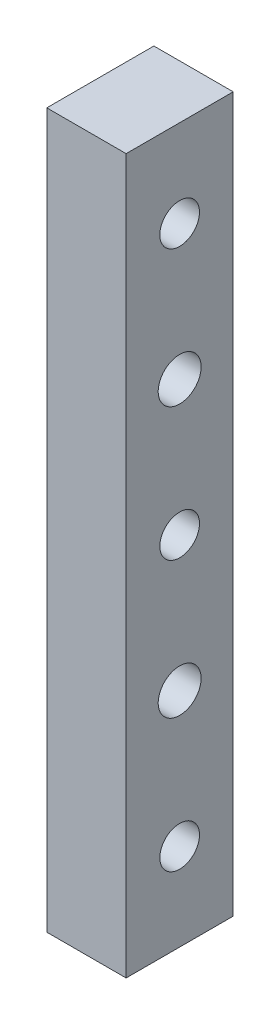
ISO-10303-21;
HEADER;
FILE_DESCRIPTION(('STEP AP214'),'2;1');
FILE_NAME('part.step','',(''),(''),'','','');
FILE_SCHEMA(('AUTOMOTIVE_DESIGN { 1 0 10303 214 1 1 1 1 }'));
ENDSEC;
DATA;
#1=APPLICATION_CONTEXT('core data for automotive mechanical design processes');
#2=APPLICATION_PROTOCOL_DEFINITION('international standard','automotive_design',2000,#1);
#3=PRODUCT_CONTEXT('',#1,'mechanical');
#4=PRODUCT('Part','Part','',(#3));
#5=PRODUCT_RELATED_PRODUCT_CATEGORY('part','',(#4));
#6=PRODUCT_DEFINITION_FORMATION('','',#4);
#7=PRODUCT_DEFINITION_CONTEXT('part definition',#1,'design');
#8=PRODUCT_DEFINITION('design','',#6,#7);
#9=PRODUCT_DEFINITION_SHAPE('','',#8);
#10=(LENGTH_UNIT() NAMED_UNIT(*) SI_UNIT(.MILLI.,.METRE.));
#11=(NAMED_UNIT(*) PLANE_ANGLE_UNIT() SI_UNIT($,.RADIAN.));
#12=(NAMED_UNIT(*) SI_UNIT($,.STERADIAN.) SOLID_ANGLE_UNIT());
#13=UNCERTAINTY_MEASURE_WITH_UNIT(LENGTH_MEASURE(1.E-05),#10,'distance_accuracy_value','');
#14=(GEOMETRIC_REPRESENTATION_CONTEXT(3) GLOBAL_UNCERTAINTY_ASSIGNED_CONTEXT((#13)) GLOBAL_UNIT_ASSIGNED_CONTEXT((#10,
#11,#12)) REPRESENTATION_CONTEXT('',''));
#15=CARTESIAN_POINT('',(0.,0.,0.));
#16=DIRECTION('',(0.,0.,1.));
#17=DIRECTION('',(1.,0.,0.));
#18=AXIS2_PLACEMENT_3D('',#15,#16,#17);
#19=CARTESIAN_POINT('',(10.,-25.3721799996099,-1.96509447423416));
#20=DIRECTION('',(1.,0.,0.));
#21=DIRECTION('',(0.,0.,-1.));
#22=AXIS2_PLACEMENT_3D('',#19,#20,#21);
#23=CYLINDRICAL_SURFACE('',#22,2.49999999999998);
#24=CARTESIAN_POINT('',(10.,-25.3721799996099,-1.96509447423416));
#25=DIRECTION('',(1.,0.,0.));
#26=DIRECTION('',(0.,0.,-1.));
#27=AXIS2_PLACEMENT_3D('',#24,#25,#26);
#28=CIRCLE('',#27,2.49999999999999);
#29=CARTESIAN_POINT('',(10.,-25.3721799996099,-4.46509447423415));
#30=VERTEX_POINT('',#29);
#31=EDGE_CURVE('E340',#30,#30,#28,.T.);
#32=ORIENTED_EDGE('',*,*,#31,.T.);
#33=EDGE_LOOP('',(#32));
#34=FACE_BOUND('',#33,.T.);
#35=CARTESIAN_POINT('',(5.,-25.3721799996099,-1.96509447423416));
#36=DIRECTION('',(-1.,0.,0.));
#37=DIRECTION('',(0.,0.,1.));
#38=AXIS2_PLACEMENT_3D('',#35,#36,#37);
#39=CIRCLE('',#38,2.49999999999998);
#40=CARTESIAN_POINT('',(5.,-25.3721799996099,0.534905525765828));
#41=VERTEX_POINT('',#40);
#42=EDGE_CURVE('E39',#41,#41,#39,.F.);
#43=ORIENTED_EDGE('',*,*,#42,.F.);
#44=EDGE_LOOP('',(#43));
#45=FACE_BOUND('',#44,.T.);
#46=ADVANCED_FACE('F35',(#34,#45),#23,.F.);
#47=CARTESIAN_POINT('',(10.,8.62782000039014,-1.96509447423415));
#48=DIRECTION('',(1.,0.,0.));
#49=DIRECTION('',(0.,0.,-1.));
#50=AXIS2_PLACEMENT_3D('',#47,#48,#49);
#51=CYLINDRICAL_SURFACE('',#50,2.49999999999999);
#52=CARTESIAN_POINT('',(10.,8.62782000039014,-1.96509447423415));
#53=DIRECTION('',(1.,0.,0.));
#54=DIRECTION('',(0.,0.,-1.));
#55=AXIS2_PLACEMENT_3D('',#52,#53,#54);
#56=CIRCLE('',#55,2.49999999999999);
#57=CARTESIAN_POINT('',(10.,8.62782000039014,-4.46509447423414));
#58=VERTEX_POINT('',#57);
#59=EDGE_CURVE('E343',#58,#58,#56,.T.);
#60=ORIENTED_EDGE('',*,*,#59,.T.);
#61=EDGE_LOOP('',(#60));
#62=FACE_BOUND('',#61,.T.);
#63=CARTESIAN_POINT('',(5.,8.62782000039014,-1.96509447423415));
#64=DIRECTION('',(-1.,0.,0.));
#65=DIRECTION('',(0.,0.,1.));
#66=AXIS2_PLACEMENT_3D('',#63,#64,#65);
#67=CIRCLE('',#66,2.49999999999999);
#68=CARTESIAN_POINT('',(5.,8.62782000039014,0.534905525765834));
#69=VERTEX_POINT('',#68);
#70=EDGE_CURVE('E278',#69,#69,#67,.F.);
#71=ORIENTED_EDGE('',*,*,#70,.F.);
#72=EDGE_LOOP('',(#71));
#73=FACE_BOUND('',#72,.T.);
#74=ADVANCED_FACE('F390',(#62,#73),#51,.F.);
#75=CARTESIAN_POINT('',(10.,42.6278200003901,-1.96509447423415));
#76=DIRECTION('',(1.,0.,0.));
#77=DIRECTION('',(0.,0.,-1.));
#78=AXIS2_PLACEMENT_3D('',#75,#76,#77);
#79=CYLINDRICAL_SURFACE('',#78,2.49999999999998);
#80=CARTESIAN_POINT('',(10.,42.6278200003901,-1.96509447423415));
#81=DIRECTION('',(1.,0.,0.));
#82=DIRECTION('',(0.,0.,-1.));
#83=AXIS2_PLACEMENT_3D('',#80,#81,#82);
#84=CIRCLE('',#83,2.49999999999999);
#85=CARTESIAN_POINT('',(10.,42.6278200003901,-4.46509447423414));
#86=VERTEX_POINT('',#85);
#87=EDGE_CURVE('E337',#86,#86,#84,.T.);
#88=ORIENTED_EDGE('',*,*,#87,.T.);
#89=EDGE_LOOP('',(#88));
#90=FACE_BOUND('',#89,.T.);
#91=CARTESIAN_POINT('',(5.,42.6278200003901,-1.96509447423415));
#92=DIRECTION('',(-1.,0.,0.));
#93=DIRECTION('',(0.,0.,1.));
#94=AXIS2_PLACEMENT_3D('',#91,#92,#93);
#95=CIRCLE('',#94,2.49999999999998);
#96=CARTESIAN_POINT('',(5.,42.6278200003901,0.534905525765836));
#97=VERTEX_POINT('',#96);
#98=EDGE_CURVE('E326',#97,#97,#95,.F.);
#99=ORIENTED_EDGE('',*,*,#98,.F.);
#100=EDGE_LOOP('',(#99));
#101=FACE_BOUND('',#100,.T.);
#102=ADVANCED_FACE('F392',(#90,#101),#79,.F.);
#103=CARTESIAN_POINT('',(10.,53.6278200003901,4.78490552576585));
#104=DIRECTION('',(0.,0.,-1.));
#105=DIRECTION('',(0.,1.,0.));
#106=AXIS2_PLACEMENT_3D('',#103,#104,#105);
#107=PLANE('',#106);
#108=DIRECTION('',(0.,-1.,0.));
#109=VECTOR('',#108,1.);
#110=CARTESIAN_POINT('',(0.,53.6278200003901,4.78490552576585));
#111=LINE('',#110,#109);
#112=CARTESIAN_POINT('',(0.,53.6278200003901,4.78490552576585));
#113=VERTEX_POINT('',#112);
#114=CARTESIAN_POINT('',(0.,-36.3721799996099,4.78490552576584));
#115=VERTEX_POINT('',#114);
#116=EDGE_CURVE('E358',#113,#115,#111,.T.);
#117=ORIENTED_EDGE('',*,*,#116,.T.);
#118=DIRECTION('',(-1.,0.,0.));
#119=VECTOR('',#118,1.);
#120=CARTESIAN_POINT('',(10.,-36.3721799996099,4.78490552576584));
#121=LINE('',#120,#119);
#122=CARTESIAN_POINT('',(10.,-36.3721799996099,4.78490552576584));
#123=VERTEX_POINT('',#122);
#124=EDGE_CURVE('E11',#123,#115,#121,.T.);
#125=ORIENTED_EDGE('',*,*,#124,.F.);
#126=DIRECTION('',(0.,-1.,0.));
#127=VECTOR('',#126,1.);
#128=CARTESIAN_POINT('',(10.,53.6278200003901,4.78490552576585));
#129=LINE('',#128,#127);
#130=CARTESIAN_POINT('',(10.,53.6278200003901,4.78490552576585));
#131=VERTEX_POINT('',#130);
#132=EDGE_CURVE('E359',#131,#123,#129,.T.);
#133=ORIENTED_EDGE('',*,*,#132,.F.);
#134=DIRECTION('',(-1.,0.,0.));
#135=VECTOR('',#134,1.);
#136=CARTESIAN_POINT('',(10.,53.6278200003901,4.78490552576585));
#137=LINE('',#136,#135);
#138=EDGE_CURVE('E369',#131,#113,#137,.T.);
#139=ORIENTED_EDGE('',*,*,#138,.T.);
#140=EDGE_LOOP('',(#117,#125,#133,#139));
#141=FACE_BOUND('',#140,.T.);
#142=ADVANCED_FACE('F37',(#141),#107,.F.);
#143=CARTESIAN_POINT('',(10.,-36.3721799996099,4.78490552576584));
#144=DIRECTION('',(0.,1.,0.));
#145=DIRECTION('',(0.,0.,1.));
#146=AXIS2_PLACEMENT_3D('',#143,#144,#145);
#147=PLANE('',#146);
#148=DIRECTION('',(0.,0.,-1.));
#149=VECTOR('',#148,1.);
#150=CARTESIAN_POINT('',(0.,-36.3721799996099,4.78490552576584));
#151=LINE('',#150,#149);
#152=CARTESIAN_POINT('',(0.,-36.3721799996099,-8.71509447423416));
#153=VERTEX_POINT('',#152);
#154=EDGE_CURVE('E372',#115,#153,#151,.T.);
#155=ORIENTED_EDGE('',*,*,#154,.T.);
#156=DIRECTION('',(-1.,0.,0.));
#157=VECTOR('',#156,1.);
#158=CARTESIAN_POINT('',(10.,-36.3721799996099,-8.71509447423416));
#159=LINE('',#158,#157);
#160=CARTESIAN_POINT('',(10.,-36.3721799996099,-8.71509447423416));
#161=VERTEX_POINT('',#160);
#162=EDGE_CURVE('E44',#161,#153,#159,.T.);
#163=ORIENTED_EDGE('',*,*,#162,.F.);
#164=DIRECTION('',(0.,0.,-1.));
#165=VECTOR('',#164,1.);
#166=CARTESIAN_POINT('',(10.,-36.3721799996099,4.78490552576584));
#167=LINE('',#166,#165);
#168=EDGE_CURVE('E362',#123,#161,#167,.T.);
#169=ORIENTED_EDGE('',*,*,#168,.F.);
#170=ORIENTED_EDGE('',*,*,#124,.T.);
#171=EDGE_LOOP('',(#155,#163,#169,#170));
#172=FACE_BOUND('',#171,.T.);
#173=ADVANCED_FACE('F427',(#172),#147,.F.);
#174=CARTESIAN_POINT('',(10.,53.6278200003901,-8.71509447423415));
#175=DIRECTION('',(0.,0.,1.));
#176=DIRECTION('',(0.,-1.,0.));
#177=AXIS2_PLACEMENT_3D('',#174,#175,#176);
#178=PLANE('',#177);
#179=DIRECTION('',(0.,1.,0.));
#180=VECTOR('',#179,1.);
#181=CARTESIAN_POINT('',(0.,53.6278200003901,-8.71509447423415));
#182=LINE('',#181,#180);
#183=CARTESIAN_POINT('',(0.,53.6278200003901,-8.71509447423415));
#184=VERTEX_POINT('',#183);
#185=EDGE_CURVE('E374',#153,#184,#182,.T.);
#186=ORIENTED_EDGE('',*,*,#185,.T.);
#187=DIRECTION('',(-1.,0.,0.));
#188=VECTOR('',#187,1.);
#189=CARTESIAN_POINT('',(10.,53.6278200003901,-8.71509447423415));
#190=LINE('',#189,#188);
#191=CARTESIAN_POINT('',(10.,53.6278200003901,-8.71509447423415));
#192=VERTEX_POINT('',#191);
#193=EDGE_CURVE('E379',#192,#184,#190,.T.);
#194=ORIENTED_EDGE('',*,*,#193,.F.);
#195=DIRECTION('',(0.,1.,0.));
#196=VECTOR('',#195,1.);
#197=CARTESIAN_POINT('',(10.,53.6278200003901,-8.71509447423415));
#198=LINE('',#197,#196);
#199=EDGE_CURVE('E365',#161,#192,#198,.T.);
#200=ORIENTED_EDGE('',*,*,#199,.F.);
#201=ORIENTED_EDGE('',*,*,#162,.T.);
#202=EDGE_LOOP('',(#186,#194,#200,#201));
#203=FACE_BOUND('',#202,.T.);
#204=ADVANCED_FACE('F424',(#203),#178,.F.);
#205=CARTESIAN_POINT('',(10.,53.6278200003901,4.78490552576585));
#206=DIRECTION('',(0.,-1.,0.));
#207=DIRECTION('',(0.,0.,-1.));
#208=AXIS2_PLACEMENT_3D('',#205,#206,#207);
#209=PLANE('',#208);
#210=DIRECTION('',(0.,0.,1.));
#211=VECTOR('',#210,1.);
#212=CARTESIAN_POINT('',(0.,53.6278200003901,4.78490552576585));
#213=LINE('',#212,#211);
#214=EDGE_CURVE('E363',#184,#113,#213,.T.);
#215=ORIENTED_EDGE('',*,*,#214,.T.);
#216=ORIENTED_EDGE('',*,*,#138,.F.);
#217=DIRECTION('',(0.,0.,1.));
#218=VECTOR('',#217,1.);
#219=CARTESIAN_POINT('',(10.,53.6278200003901,4.78490552576585));
#220=LINE('',#219,#218);
#221=EDGE_CURVE('E367',#192,#131,#220,.T.);
#222=ORIENTED_EDGE('',*,*,#221,.F.);
#223=ORIENTED_EDGE('',*,*,#193,.T.);
#224=EDGE_LOOP('',(#215,#216,#222,#223));
#225=FACE_BOUND('',#224,.T.);
#226=ADVANCED_FACE('F417',(#225),#209,.F.);
#227=CARTESIAN_POINT('',(10.,-36.3721799996099,4.78490552576584));
#228=DIRECTION('',(1.,0.,0.));
#229=DIRECTION('',(0.,0.,-1.));
#230=AXIS2_PLACEMENT_3D('',#227,#228,#229);
#231=PLANE('',#230);
#232=ORIENTED_EDGE('',*,*,#87,.F.);
#233=EDGE_LOOP('',(#232));
#234=FACE_BOUND('',#233,.T.);
#235=ORIENTED_EDGE('',*,*,#31,.F.);
#236=EDGE_LOOP('',(#235));
#237=FACE_BOUND('',#236,.T.);
#238=ORIENTED_EDGE('',*,*,#59,.F.);
#239=EDGE_LOOP('',(#238));
#240=FACE_BOUND('',#239,.T.);
#241=CARTESIAN_POINT('',(10.,25.6278200003901,-1.96509447423415));
#242=DIRECTION('',(1.,0.,0.));
#243=DIRECTION('',(0.,0.,-1.));
#244=AXIS2_PLACEMENT_3D('',#241,#242,#243);
#245=CIRCLE('',#244,2.70509999999999);
#246=CARTESIAN_POINT('',(10.,25.6278200003901,-4.67019447423414));
#247=VERTEX_POINT('',#246);
#248=EDGE_CURVE('E346',#247,#247,#245,.T.);
#249=ORIENTED_EDGE('',*,*,#248,.F.);
#250=EDGE_LOOP('',(#249));
#251=FACE_BOUND('',#250,.T.);
#252=CARTESIAN_POINT('',(10.,-8.37217999960986,-1.96509447423416));
#253=DIRECTION('',(1.,0.,0.));
#254=DIRECTION('',(0.,0.,-1.));
#255=AXIS2_PLACEMENT_3D('',#252,#253,#254);
#256=CIRCLE('',#255,2.70509999999999);
#257=CARTESIAN_POINT('',(10.,-8.37217999960986,-4.67019447423414));
#258=VERTEX_POINT('',#257);
#259=EDGE_CURVE('E352',#258,#258,#256,.T.);
#260=ORIENTED_EDGE('',*,*,#259,.F.);
#261=EDGE_LOOP('',(#260));
#262=FACE_BOUND('',#261,.T.);
#263=ORIENTED_EDGE('',*,*,#132,.T.);
#264=ORIENTED_EDGE('',*,*,#168,.T.);
#265=ORIENTED_EDGE('',*,*,#199,.T.);
#266=ORIENTED_EDGE('',*,*,#221,.T.);
#267=EDGE_LOOP('',(#263,#264,#265,#266));
#268=FACE_BOUND('',#267,.T.);
#269=ADVANCED_FACE('F414',(#234,#237,#240,#251,#262,#268),#231,.T.);
#270=CARTESIAN_POINT('',(0.,-36.3721799996099,4.78490552576584));
#271=DIRECTION('',(1.,0.,0.));
#272=DIRECTION('',(0.,0.,-1.));
#273=AXIS2_PLACEMENT_3D('',#270,#271,#272);
#274=PLANE('',#273);
#275=DIRECTION('',(0.,1.,0.));
#276=VECTOR('',#275,1.);
#277=CARTESIAN_POINT('',(0.,-27.6671473196386,2.00990552576584));
#278=LINE('',#277,#276);
#279=CARTESIAN_POINT('',(0.,-27.6671473196386,2.00990552576584));
#280=VERTEX_POINT('',#279);
#281=CARTESIAN_POINT('',(0.,-23.0772126795811,2.00990552576584));
#282=VERTEX_POINT('',#281);
#283=EDGE_CURVE('E222',#280,#282,#278,.T.);
#284=ORIENTED_EDGE('',*,*,#283,.F.);
#285=DIRECTION('',(0.,0.5,0.866025403784438));
#286=VECTOR('',#285,1.);
#287=CARTESIAN_POINT('',(0.,-29.9621146396674,-1.96509447423416));
#288=LINE('',#287,#286);
#289=CARTESIAN_POINT('',(0.,-29.9621146396674,-1.96509447423416));
#290=VERTEX_POINT('',#289);
#291=EDGE_CURVE('E52',#290,#280,#288,.T.);
#292=ORIENTED_EDGE('',*,*,#291,.F.);
#293=DIRECTION('',(0.,-0.5,0.866025403784438));
#294=VECTOR('',#293,1.);
#295=CARTESIAN_POINT('',(0.,-27.6671473196386,-5.94009447423416));
#296=LINE('',#295,#294);
#297=CARTESIAN_POINT('',(0.,-27.6671473196386,-5.94009447423416));
#298=VERTEX_POINT('',#297);
#299=EDGE_CURVE('E208',#298,#290,#296,.T.);
#300=ORIENTED_EDGE('',*,*,#299,.F.);
#301=DIRECTION('',(0.,-1.,0.));
#302=VECTOR('',#301,1.);
#303=CARTESIAN_POINT('',(0.,-23.0772126795811,-5.94009447423416));
#304=LINE('',#303,#302);
#305=CARTESIAN_POINT('',(0.,-23.0772126795811,-5.94009447423416));
#306=VERTEX_POINT('',#305);
#307=EDGE_CURVE('E211',#306,#298,#304,.T.);
#308=ORIENTED_EDGE('',*,*,#307,.F.);
#309=DIRECTION('',(0.,-0.5,-0.866025403784438));
#310=VECTOR('',#309,1.);
#311=CARTESIAN_POINT('',(0.,-20.7822453595523,-1.96509447423416));
#312=LINE('',#311,#310);
#313=CARTESIAN_POINT('',(0.,-20.7822453595523,-1.96509447423416));
#314=VERTEX_POINT('',#313);
#315=EDGE_CURVE('E227',#314,#306,#312,.T.);
#316=ORIENTED_EDGE('',*,*,#315,.F.);
#317=DIRECTION('',(0.,0.5,-0.866025403784439));
#318=VECTOR('',#317,1.);
#319=CARTESIAN_POINT('',(0.,-23.0772126795811,2.00990552576584));
#320=LINE('',#319,#318);
#321=EDGE_CURVE('E224',#282,#314,#320,.T.);
#322=ORIENTED_EDGE('',*,*,#321,.F.);
#323=EDGE_LOOP('',(#284,#292,#300,#308,#316,#322));
#324=FACE_BOUND('',#323,.T.);
#325=DIRECTION('',(0.,1.,0.));
#326=VECTOR('',#325,1.);
#327=CARTESIAN_POINT('',(0.,6.33285268036138,2.00990552576582));
#328=LINE('',#327,#326);
#329=CARTESIAN_POINT('',(0.,6.33285268036138,2.00990552576582));
#330=VERTEX_POINT('',#329);
#331=CARTESIAN_POINT('',(0.,10.9227873204189,2.00990552576582));
#332=VERTEX_POINT('',#331);
#333=EDGE_CURVE('E262',#330,#332,#328,.T.);
#334=ORIENTED_EDGE('',*,*,#333,.F.);
#335=DIRECTION('',(0.,0.499999999999999,0.866025403784439));
#336=VECTOR('',#335,1.);
#337=CARTESIAN_POINT('',(0.,4.03788536033264,-1.96509447423415));
#338=LINE('',#337,#336);
#339=CARTESIAN_POINT('',(0.,4.03788536033264,-1.96509447423415));
#340=VERTEX_POINT('',#339);
#341=EDGE_CURVE('E60',#340,#330,#338,.T.);
#342=ORIENTED_EDGE('',*,*,#341,.F.);
#343=DIRECTION('',(0.,-0.5,0.866025403784439));
#344=VECTOR('',#343,1.);
#345=CARTESIAN_POINT('',(0.,6.33285268036139,-5.94009447423413));
#346=LINE('',#345,#344);
#347=CARTESIAN_POINT('',(0.,6.33285268036139,-5.94009447423413));
#348=VERTEX_POINT('',#347);
#349=EDGE_CURVE('E245',#348,#340,#346,.T.);
#350=ORIENTED_EDGE('',*,*,#349,.F.);
#351=DIRECTION('',(0.,-1.,0.));
#352=VECTOR('',#351,1.);
#353=CARTESIAN_POINT('',(0.,10.9227873204189,-5.94009447423413));
#354=LINE('',#353,#352);
#355=CARTESIAN_POINT('',(0.,10.9227873204189,-5.94009447423413));
#356=VERTEX_POINT('',#355);
#357=EDGE_CURVE('E271',#356,#348,#354,.T.);
#358=ORIENTED_EDGE('',*,*,#357,.F.);
#359=DIRECTION('',(0.,-0.5,-0.866025403784439));
#360=VECTOR('',#359,1.);
#361=CARTESIAN_POINT('',(0.,13.2177546404476,-1.96509447423415));
#362=LINE('',#361,#360);
#363=CARTESIAN_POINT('',(0.,13.2177546404476,-1.96509447423415));
#364=VERTEX_POINT('',#363);
#365=EDGE_CURVE('E268',#364,#356,#362,.T.);
#366=ORIENTED_EDGE('',*,*,#365,.F.);
#367=DIRECTION('',(0.,0.5,-0.866025403784439));
#368=VECTOR('',#367,1.);
#369=CARTESIAN_POINT('',(0.,10.9227873204189,2.00990552576582));
#370=LINE('',#369,#368);
#371=EDGE_CURVE('E265',#332,#364,#370,.T.);
#372=ORIENTED_EDGE('',*,*,#371,.F.);
#373=EDGE_LOOP('',(#334,#342,#350,#358,#366,#372));
#374=FACE_BOUND('',#373,.T.);
#375=DIRECTION('',(0.,1.,0.));
#376=VECTOR('',#375,1.);
#377=CARTESIAN_POINT('',(0.,40.3328526803614,2.00990552576585));
#378=LINE('',#377,#376);
#379=CARTESIAN_POINT('',(0.,40.3328526803614,2.00990552576585));
#380=VERTEX_POINT('',#379);
#381=CARTESIAN_POINT('',(0.,44.9227873204189,2.00990552576585));
#382=VERTEX_POINT('',#381);
#383=EDGE_CURVE('E310',#380,#382,#378,.T.);
#384=ORIENTED_EDGE('',*,*,#383,.F.);
#385=DIRECTION('',(0.,0.5,0.866025403784439));
#386=VECTOR('',#385,1.);
#387=CARTESIAN_POINT('',(0.,38.0378853603326,-1.96509447423415));
#388=LINE('',#387,#386);
#389=CARTESIAN_POINT('',(0.,38.0378853603326,-1.96509447423415));
#390=VERTEX_POINT('',#389);
#391=EDGE_CURVE('E308',#390,#380,#388,.T.);
#392=ORIENTED_EDGE('',*,*,#391,.F.);
#393=DIRECTION('',(0.,-0.5,0.866025403784438));
#394=VECTOR('',#393,1.);
#395=CARTESIAN_POINT('',(0.,40.3328526803614,-5.94009447423415));
#396=LINE('',#395,#394);
#397=CARTESIAN_POINT('',(0.,40.3328526803614,-5.94009447423415));
#398=VERTEX_POINT('',#397);
#399=EDGE_CURVE('E292',#398,#390,#396,.T.);
#400=ORIENTED_EDGE('',*,*,#399,.F.);
#401=DIRECTION('',(0.,-1.,0.));
#402=VECTOR('',#401,1.);
#403=CARTESIAN_POINT('',(0.,44.9227873204189,-5.94009447423415));
#404=LINE('',#403,#402);
#405=CARTESIAN_POINT('',(0.,44.9227873204189,-5.94009447423415));
#406=VERTEX_POINT('',#405);
#407=EDGE_CURVE('E319',#406,#398,#404,.T.);
#408=ORIENTED_EDGE('',*,*,#407,.F.);
#409=DIRECTION('',(0.,-0.5,-0.866025403784439));
#410=VECTOR('',#409,1.);
#411=CARTESIAN_POINT('',(0.,47.2177546404477,-1.96509447423415));
#412=LINE('',#411,#410);
#413=CARTESIAN_POINT('',(0.,47.2177546404477,-1.96509447423415));
#414=VERTEX_POINT('',#413);
#415=EDGE_CURVE('E316',#414,#406,#412,.T.);
#416=ORIENTED_EDGE('',*,*,#415,.F.);
#417=DIRECTION('',(0.,0.5,-0.866025403784439));
#418=VECTOR('',#417,1.);
#419=CARTESIAN_POINT('',(0.,44.9227873204189,2.00990552576585));
#420=LINE('',#419,#418);
#421=EDGE_CURVE('E313',#382,#414,#420,.T.);
#422=ORIENTED_EDGE('',*,*,#421,.F.);
#423=EDGE_LOOP('',(#384,#392,#400,#408,#416,#422));
#424=FACE_BOUND('',#423,.T.);
#425=CARTESIAN_POINT('',(0.,25.6278200003901,-1.96509447423415));
#426=DIRECTION('',(1.,0.,0.));
#427=DIRECTION('',(0.,0.,-1.));
#428=AXIS2_PLACEMENT_3D('',#425,#426,#427);
#429=CIRCLE('',#428,2.7051);
#430=CARTESIAN_POINT('',(0.,25.6278200003901,-4.67019447423415));
#431=VERTEX_POINT('',#430);
#432=EDGE_CURVE('E349',#431,#431,#429,.T.);
#433=ORIENTED_EDGE('',*,*,#432,.T.);
#434=EDGE_LOOP('',(#433));
#435=FACE_BOUND('',#434,.T.);
#436=CARTESIAN_POINT('',(0.,-8.37217999960986,-1.96509447423416));
#437=DIRECTION('',(1.,0.,0.));
#438=DIRECTION('',(0.,0.,-1.));
#439=AXIS2_PLACEMENT_3D('',#436,#437,#438);
#440=CIRCLE('',#439,2.7051);
#441=CARTESIAN_POINT('',(0.,-8.37217999960986,-4.67019447423415));
#442=VERTEX_POINT('',#441);
#443=EDGE_CURVE('E355',#442,#442,#440,.T.);
#444=ORIENTED_EDGE('',*,*,#443,.T.);
#445=EDGE_LOOP('',(#444));
#446=FACE_BOUND('',#445,.T.);
#447=ORIENTED_EDGE('',*,*,#116,.F.);
#448=ORIENTED_EDGE('',*,*,#214,.F.);
#449=ORIENTED_EDGE('',*,*,#185,.F.);
#450=ORIENTED_EDGE('',*,*,#154,.F.);
#451=EDGE_LOOP('',(#447,#448,#449,#450));
#452=FACE_BOUND('',#451,.T.);
#453=ADVANCED_FACE('F412',(#324,#374,#424,#435,#446,#452),#274,.F.);
#454=CARTESIAN_POINT('',(10.,-8.37217999960986,-1.96509447423416));
#455=DIRECTION('',(1.,0.,0.));
#456=DIRECTION('',(0.,0.,-1.));
#457=AXIS2_PLACEMENT_3D('',#454,#455,#456);
#458=CYLINDRICAL_SURFACE('',#457,2.70509999999999);
#459=ORIENTED_EDGE('',*,*,#443,.F.);
#460=EDGE_LOOP('',(#459));
#461=FACE_BOUND('',#460,.T.);
#462=ORIENTED_EDGE('',*,*,#259,.T.);
#463=EDGE_LOOP('',(#462));
#464=FACE_BOUND('',#463,.T.);
#465=ADVANCED_FACE('F408',(#461,#464),#458,.F.);
#466=CARTESIAN_POINT('',(10.,25.6278200003901,-1.96509447423415));
#467=DIRECTION('',(1.,0.,0.));
#468=DIRECTION('',(0.,0.,-1.));
#469=AXIS2_PLACEMENT_3D('',#466,#467,#468);
#470=CYLINDRICAL_SURFACE('',#469,2.70509999999999);
#471=ORIENTED_EDGE('',*,*,#432,.F.);
#472=EDGE_LOOP('',(#471));
#473=FACE_BOUND('',#472,.T.);
#474=ORIENTED_EDGE('',*,*,#248,.T.);
#475=EDGE_LOOP('',(#474));
#476=FACE_BOUND('',#475,.T.);
#477=ADVANCED_FACE('F404',(#473,#476),#470,.F.);
#478=CARTESIAN_POINT('',(5.,40.3328526803614,2.00990552576585));
#479=DIRECTION('',(-1.,0.,0.));
#480=DIRECTION('',(0.,0.,1.));
#481=AXIS2_PLACEMENT_3D('',#478,#479,#480);
#482=PLANE('',#481);
#483=DIRECTION('',(0.,0.5,0.866025403784439));
#484=VECTOR('',#483,1.);
#485=CARTESIAN_POINT('',(5.,38.0378853603326,-1.96509447423415));
#486=LINE('',#485,#484);
#487=CARTESIAN_POINT('',(5.,38.0378853603326,-1.96509447423415));
#488=VERTEX_POINT('',#487);
#489=CARTESIAN_POINT('',(5.,40.3328526803614,2.00990552576585));
#490=VERTEX_POINT('',#489);
#491=EDGE_CURVE('E288',#488,#490,#486,.T.);
#492=ORIENTED_EDGE('',*,*,#491,.T.);
#493=DIRECTION('',(0.,1.,0.));
#494=VECTOR('',#493,1.);
#495=CARTESIAN_POINT('',(5.,40.3328526803614,2.00990552576585));
#496=LINE('',#495,#494);
#497=CARTESIAN_POINT('',(5.,44.9227873204189,2.00990552576585));
#498=VERTEX_POINT('',#497);
#499=EDGE_CURVE('E291',#490,#498,#496,.T.);
#500=ORIENTED_EDGE('',*,*,#499,.T.);
#501=DIRECTION('',(0.,0.5,-0.866025403784439));
#502=VECTOR('',#501,1.);
#503=CARTESIAN_POINT('',(5.,44.9227873204189,2.00990552576585));
#504=LINE('',#503,#502);
#505=CARTESIAN_POINT('',(5.,47.2177546404477,-1.96509447423415));
#506=VERTEX_POINT('',#505);
#507=EDGE_CURVE('E295',#498,#506,#504,.T.);
#508=ORIENTED_EDGE('',*,*,#507,.T.);
#509=DIRECTION('',(0.,-0.5,-0.866025403784439));
#510=VECTOR('',#509,1.);
#511=CARTESIAN_POINT('',(5.,47.2177546404477,-1.96509447423415));
#512=LINE('',#511,#510);
#513=CARTESIAN_POINT('',(5.,44.9227873204189,-5.94009447423415));
#514=VERTEX_POINT('',#513);
#515=EDGE_CURVE('E298',#506,#514,#512,.T.);
#516=ORIENTED_EDGE('',*,*,#515,.T.);
#517=DIRECTION('',(0.,-1.,0.));
#518=VECTOR('',#517,1.);
#519=CARTESIAN_POINT('',(5.,44.9227873204189,-5.94009447423415));
#520=LINE('',#519,#518);
#521=CARTESIAN_POINT('',(5.,40.3328526803614,-5.94009447423415));
#522=VERTEX_POINT('',#521);
#523=EDGE_CURVE('E301',#514,#522,#520,.T.);
#524=ORIENTED_EDGE('',*,*,#523,.T.);
#525=DIRECTION('',(0.,-0.5,0.866025403784438));
#526=VECTOR('',#525,1.);
#527=CARTESIAN_POINT('',(5.,40.3328526803614,-5.94009447423415));
#528=LINE('',#527,#526);
#529=EDGE_CURVE('E304',#522,#488,#528,.T.);
#530=ORIENTED_EDGE('',*,*,#529,.T.);
#531=EDGE_LOOP('',(#492,#500,#508,#516,#524,#530));
#532=FACE_BOUND('',#531,.T.);
#533=ORIENTED_EDGE('',*,*,#98,.T.);
#534=EDGE_LOOP('',(#533));
#535=FACE_BOUND('',#534,.T.);
#536=ADVANCED_FACE('F407',(#532,#535),#482,.T.);
#537=CARTESIAN_POINT('',(5.,38.0378853603326,-1.96509447423415));
#538=DIRECTION('',(0.,-0.866025403784439,0.5));
#539=DIRECTION('',(0.,-0.5,-0.866025403784439));
#540=AXIS2_PLACEMENT_3D('',#537,#538,#539);
#541=PLANE('',#540);
#542=ORIENTED_EDGE('',*,*,#391,.T.);
#543=DIRECTION('',(-1.,0.,0.));
#544=VECTOR('',#543,1.);
#545=CARTESIAN_POINT('',(5.,40.3328526803614,2.00990552576585));
#546=LINE('',#545,#544);
#547=EDGE_CURVE('E307',#490,#380,#546,.T.);
#548=ORIENTED_EDGE('',*,*,#547,.F.);
#549=ORIENTED_EDGE('',*,*,#491,.F.);
#550=DIRECTION('',(-1.,0.,0.));
#551=VECTOR('',#550,1.);
#552=CARTESIAN_POINT('',(5.,38.0378853603326,-1.96509447423415));
#553=LINE('',#552,#551);
#554=EDGE_CURVE('E324',#488,#390,#553,.T.);
#555=ORIENTED_EDGE('',*,*,#554,.T.);
#556=EDGE_LOOP('',(#542,#548,#549,#555));
#557=FACE_BOUND('',#556,.T.);
#558=ADVANCED_FACE('F474',(#557),#541,.F.);
#559=CARTESIAN_POINT('',(5.,40.3328526803614,-5.94009447423415));
#560=DIRECTION('',(0.,-0.866025403784438,-0.5));
#561=DIRECTION('',(0.,0.5,-0.866025403784439));
#562=AXIS2_PLACEMENT_3D('',#559,#560,#561);
#563=PLANE('',#562);
#564=ORIENTED_EDGE('',*,*,#399,.T.);
#565=ORIENTED_EDGE('',*,*,#554,.F.);
#566=ORIENTED_EDGE('',*,*,#529,.F.);
#567=DIRECTION('',(-1.,0.,0.));
#568=VECTOR('',#567,1.);
#569=CARTESIAN_POINT('',(5.,40.3328526803614,-5.94009447423415));
#570=LINE('',#569,#568);
#571=EDGE_CURVE('E327',#522,#398,#570,.T.);
#572=ORIENTED_EDGE('',*,*,#571,.T.);
#573=EDGE_LOOP('',(#564,#565,#566,#572));
#574=FACE_BOUND('',#573,.T.);
#575=ADVANCED_FACE('F485',(#574),#563,.F.);
#576=CARTESIAN_POINT('',(5.,44.9227873204189,-5.94009447423415));
#577=DIRECTION('',(0.,0.,-1.));
#578=DIRECTION('',(-1.,0.,0.));
#579=AXIS2_PLACEMENT_3D('',#576,#577,#578);
#580=PLANE('',#579);
#581=ORIENTED_EDGE('',*,*,#407,.T.);
#582=ORIENTED_EDGE('',*,*,#571,.F.);
#583=ORIENTED_EDGE('',*,*,#523,.F.);
#584=DIRECTION('',(-1.,0.,0.));
#585=VECTOR('',#584,1.);
#586=CARTESIAN_POINT('',(5.,44.9227873204189,-5.94009447423415));
#587=LINE('',#586,#585);
#588=EDGE_CURVE('E329',#514,#406,#587,.T.);
#589=ORIENTED_EDGE('',*,*,#588,.T.);
#590=EDGE_LOOP('',(#581,#582,#583,#589));
#591=FACE_BOUND('',#590,.T.);
#592=ADVANCED_FACE('F495',(#591),#580,.F.);
#593=CARTESIAN_POINT('',(5.,47.2177546404477,-1.96509447423415));
#594=DIRECTION('',(0.,0.866025403784439,-0.5));
#595=DIRECTION('',(0.,0.5,0.866025403784439));
#596=AXIS2_PLACEMENT_3D('',#593,#594,#595);
#597=PLANE('',#596);
#598=ORIENTED_EDGE('',*,*,#415,.T.);
#599=ORIENTED_EDGE('',*,*,#588,.F.);
#600=ORIENTED_EDGE('',*,*,#515,.F.);
#601=DIRECTION('',(-1.,0.,0.));
#602=VECTOR('',#601,1.);
#603=CARTESIAN_POINT('',(5.,47.2177546404477,-1.96509447423415));
#604=LINE('',#603,#602);
#605=EDGE_CURVE('E331',#506,#414,#604,.T.);
#606=ORIENTED_EDGE('',*,*,#605,.T.);
#607=EDGE_LOOP('',(#598,#599,#600,#606));
#608=FACE_BOUND('',#607,.T.);
#609=ADVANCED_FACE('F505',(#608),#597,.F.);
#610=CARTESIAN_POINT('',(5.,44.9227873204189,2.00990552576585));
#611=DIRECTION('',(0.,0.866025403784439,0.5));
#612=DIRECTION('',(0.,-0.5,0.866025403784439));
#613=AXIS2_PLACEMENT_3D('',#610,#611,#612);
#614=PLANE('',#613);
#615=ORIENTED_EDGE('',*,*,#421,.T.);
#616=ORIENTED_EDGE('',*,*,#605,.F.);
#617=ORIENTED_EDGE('',*,*,#507,.F.);
#618=DIRECTION('',(-1.,0.,0.));
#619=VECTOR('',#618,1.);
#620=CARTESIAN_POINT('',(5.,44.9227873204189,2.00990552576585));
#621=LINE('',#620,#619);
#622=EDGE_CURVE('E333',#498,#382,#621,.T.);
#623=ORIENTED_EDGE('',*,*,#622,.T.);
#624=EDGE_LOOP('',(#615,#616,#617,#623));
#625=FACE_BOUND('',#624,.T.);
#626=ADVANCED_FACE('F515',(#625),#614,.F.);
#627=CARTESIAN_POINT('',(5.,40.3328526803614,2.00990552576585));
#628=DIRECTION('',(0.,0.,1.));
#629=DIRECTION('',(0.,-1.,0.));
#630=AXIS2_PLACEMENT_3D('',#627,#628,#629);
#631=PLANE('',#630);
#632=ORIENTED_EDGE('',*,*,#383,.T.);
#633=ORIENTED_EDGE('',*,*,#622,.F.);
#634=ORIENTED_EDGE('',*,*,#499,.F.);
#635=ORIENTED_EDGE('',*,*,#547,.T.);
#636=EDGE_LOOP('',(#632,#633,#634,#635));
#637=FACE_BOUND('',#636,.T.);
#638=ADVANCED_FACE('F525',(#637),#631,.F.);
#639=CARTESIAN_POINT('',(5.,6.33285268036138,2.00990552576582));
#640=DIRECTION('',(-1.,0.,0.));
#641=DIRECTION('',(0.,0.,1.));
#642=AXIS2_PLACEMENT_3D('',#639,#640,#641);
#643=PLANE('',#642);
#644=DIRECTION('',(0.,0.499999999999999,0.866025403784439));
#645=VECTOR('',#644,1.);
#646=CARTESIAN_POINT('',(5.,4.03788536033264,-1.96509447423415));
#647=LINE('',#646,#645);
#648=CARTESIAN_POINT('',(5.,4.03788536033264,-1.96509447423415));
#649=VERTEX_POINT('',#648);
#650=CARTESIAN_POINT('',(5.,6.33285268036138,2.00990552576582));
#651=VERTEX_POINT('',#650);
#652=EDGE_CURVE('E241',#649,#651,#647,.T.);
#653=ORIENTED_EDGE('',*,*,#652,.T.);
#654=DIRECTION('',(0.,1.,0.));
#655=VECTOR('',#654,1.);
#656=CARTESIAN_POINT('',(5.,6.33285268036138,2.00990552576582));
#657=LINE('',#656,#655);
#658=CARTESIAN_POINT('',(5.,10.9227873204189,2.00990552576582));
#659=VERTEX_POINT('',#658);
#660=EDGE_CURVE('E244',#651,#659,#657,.T.);
#661=ORIENTED_EDGE('',*,*,#660,.T.);
#662=DIRECTION('',(0.,0.5,-0.866025403784439));
#663=VECTOR('',#662,1.);
#664=CARTESIAN_POINT('',(5.,10.9227873204189,2.00990552576582));
#665=LINE('',#664,#663);
#666=CARTESIAN_POINT('',(5.,13.2177546404476,-1.96509447423415));
#667=VERTEX_POINT('',#666);
#668=EDGE_CURVE('E248',#659,#667,#665,.T.);
#669=ORIENTED_EDGE('',*,*,#668,.T.);
#670=DIRECTION('',(0.,-0.5,-0.866025403784439));
#671=VECTOR('',#670,1.);
#672=CARTESIAN_POINT('',(5.,13.2177546404476,-1.96509447423415));
#673=LINE('',#672,#671);
#674=CARTESIAN_POINT('',(5.,10.9227873204189,-5.94009447423413));
#675=VERTEX_POINT('',#674);
#676=EDGE_CURVE('E251',#667,#675,#673,.T.);
#677=ORIENTED_EDGE('',*,*,#676,.T.);
#678=DIRECTION('',(0.,-1.,0.));
#679=VECTOR('',#678,1.);
#680=CARTESIAN_POINT('',(5.,10.9227873204189,-5.94009447423413));
#681=LINE('',#680,#679);
#682=CARTESIAN_POINT('',(5.,6.33285268036139,-5.94009447423413));
#683=VERTEX_POINT('',#682);
#684=EDGE_CURVE('E254',#675,#683,#681,.T.);
#685=ORIENTED_EDGE('',*,*,#684,.T.);
#686=DIRECTION('',(0.,-0.5,0.866025403784439));
#687=VECTOR('',#686,1.);
#688=CARTESIAN_POINT('',(5.,6.33285268036139,-5.94009447423413));
#689=LINE('',#688,#687);
#690=EDGE_CURVE('E257',#683,#649,#689,.T.);
#691=ORIENTED_EDGE('',*,*,#690,.T.);
#692=EDGE_LOOP('',(#653,#661,#669,#677,#685,#691));
#693=FACE_BOUND('',#692,.T.);
#694=ORIENTED_EDGE('',*,*,#70,.T.);
#695=EDGE_LOOP('',(#694));
#696=FACE_BOUND('',#695,.T.);
#697=ADVANCED_FACE('F388',(#693,#696),#643,.T.);
#698=CARTESIAN_POINT('',(5.,4.03788536033264,-1.96509447423415));
#699=DIRECTION('',(0.,-0.866025403784439,0.499999999999999));
#700=DIRECTION('',(0.,-0.499999999999999,-0.866025403784439));
#701=AXIS2_PLACEMENT_3D('',#698,#699,#700);
#702=PLANE('',#701);
#703=ORIENTED_EDGE('',*,*,#341,.T.);
#704=DIRECTION('',(-1.,0.,0.));
#705=VECTOR('',#704,1.);
#706=CARTESIAN_POINT('',(5.,6.33285268036138,2.00990552576582));
#707=LINE('',#706,#705);
#708=EDGE_CURVE('E260',#651,#330,#707,.T.);
#709=ORIENTED_EDGE('',*,*,#708,.F.);
#710=ORIENTED_EDGE('',*,*,#652,.F.);
#711=DIRECTION('',(-1.,0.,0.));
#712=VECTOR('',#711,1.);
#713=CARTESIAN_POINT('',(5.,4.03788536033264,-1.96509447423415));
#714=LINE('',#713,#712);
#715=EDGE_CURVE('E276',#649,#340,#714,.T.);
#716=ORIENTED_EDGE('',*,*,#715,.T.);
#717=EDGE_LOOP('',(#703,#709,#710,#716));
#718=FACE_BOUND('',#717,.T.);
#719=ADVANCED_FACE('F544',(#718),#702,.F.);
#720=CARTESIAN_POINT('',(5.,6.33285268036139,-5.94009447423413));
#721=DIRECTION('',(0.,-0.866025403784439,-0.5));
#722=DIRECTION('',(0.,0.5,-0.866025403784439));
#723=AXIS2_PLACEMENT_3D('',#720,#721,#722);
#724=PLANE('',#723);
#725=ORIENTED_EDGE('',*,*,#349,.T.);
#726=ORIENTED_EDGE('',*,*,#715,.F.);
#727=ORIENTED_EDGE('',*,*,#690,.F.);
#728=DIRECTION('',(-1.,0.,0.));
#729=VECTOR('',#728,1.);
#730=CARTESIAN_POINT('',(5.,6.33285268036139,-5.94009447423413));
#731=LINE('',#730,#729);
#732=EDGE_CURVE('E279',#683,#348,#731,.T.);
#733=ORIENTED_EDGE('',*,*,#732,.T.);
#734=EDGE_LOOP('',(#725,#726,#727,#733));
#735=FACE_BOUND('',#734,.T.);
#736=ADVANCED_FACE('F554',(#735),#724,.F.);
#737=CARTESIAN_POINT('',(5.,10.9227873204189,-5.94009447423413));
#738=DIRECTION('',(0.,0.,-1.));
#739=DIRECTION('',(0.,1.,0.));
#740=AXIS2_PLACEMENT_3D('',#737,#738,#739);
#741=PLANE('',#740);
#742=ORIENTED_EDGE('',*,*,#357,.T.);
#743=ORIENTED_EDGE('',*,*,#732,.F.);
#744=ORIENTED_EDGE('',*,*,#684,.F.);
#745=DIRECTION('',(-1.,0.,0.));
#746=VECTOR('',#745,1.);
#747=CARTESIAN_POINT('',(5.,10.9227873204189,-5.94009447423413));
#748=LINE('',#747,#746);
#749=EDGE_CURVE('E281',#675,#356,#748,.T.);
#750=ORIENTED_EDGE('',*,*,#749,.T.);
#751=EDGE_LOOP('',(#742,#743,#744,#750));
#752=FACE_BOUND('',#751,.T.);
#753=ADVANCED_FACE('F563',(#752),#741,.F.);
#754=CARTESIAN_POINT('',(5.,13.2177546404476,-1.96509447423415));
#755=DIRECTION('',(0.,0.866025403784439,-0.5));
#756=DIRECTION('',(0.,0.5,0.866025403784439));
#757=AXIS2_PLACEMENT_3D('',#754,#755,#756);
#758=PLANE('',#757);
#759=ORIENTED_EDGE('',*,*,#365,.T.);
#760=ORIENTED_EDGE('',*,*,#749,.F.);
#761=ORIENTED_EDGE('',*,*,#676,.F.);
#762=DIRECTION('',(-1.,0.,0.));
#763=VECTOR('',#762,1.);
#764=CARTESIAN_POINT('',(5.,13.2177546404476,-1.96509447423415));
#765=LINE('',#764,#763);
#766=EDGE_CURVE('E283',#667,#364,#765,.T.);
#767=ORIENTED_EDGE('',*,*,#766,.T.);
#768=EDGE_LOOP('',(#759,#760,#761,#767));
#769=FACE_BOUND('',#768,.T.);
#770=ADVANCED_FACE('F573',(#769),#758,.F.);
#771=CARTESIAN_POINT('',(5.,10.9227873204189,2.00990552576582));
#772=DIRECTION('',(0.,0.866025403784439,0.5));
#773=DIRECTION('',(0.,-0.5,0.866025403784439));
#774=AXIS2_PLACEMENT_3D('',#771,#772,#773);
#775=PLANE('',#774);
#776=ORIENTED_EDGE('',*,*,#371,.T.);
#777=ORIENTED_EDGE('',*,*,#766,.F.);
#778=ORIENTED_EDGE('',*,*,#668,.F.);
#779=DIRECTION('',(-1.,0.,0.));
#780=VECTOR('',#779,1.);
#781=CARTESIAN_POINT('',(5.,10.9227873204189,2.00990552576582));
#782=LINE('',#781,#780);
#783=EDGE_CURVE('E285',#659,#332,#782,.T.);
#784=ORIENTED_EDGE('',*,*,#783,.T.);
#785=EDGE_LOOP('',(#776,#777,#778,#784));
#786=FACE_BOUND('',#785,.T.);
#787=ADVANCED_FACE('F583',(#786),#775,.F.);
#788=CARTESIAN_POINT('',(5.,6.33285268036138,2.00990552576582));
#789=DIRECTION('',(0.,0.,1.));
#790=DIRECTION('',(0.,-1.,0.));
#791=AXIS2_PLACEMENT_3D('',#788,#789,#790);
#792=PLANE('',#791);
#793=ORIENTED_EDGE('',*,*,#333,.T.);
#794=ORIENTED_EDGE('',*,*,#783,.F.);
#795=ORIENTED_EDGE('',*,*,#660,.F.);
#796=ORIENTED_EDGE('',*,*,#708,.T.);
#797=EDGE_LOOP('',(#793,#794,#795,#796));
#798=FACE_BOUND('',#797,.T.);
#799=ADVANCED_FACE('F593',(#798),#792,.F.);
#800=CARTESIAN_POINT('',(5.,-27.6671473196386,2.00990552576584));
#801=DIRECTION('',(-1.,0.,0.));
#802=DIRECTION('',(0.,0.,1.));
#803=AXIS2_PLACEMENT_3D('',#800,#801,#802);
#804=PLANE('',#803);
#805=DIRECTION('',(0.,0.5,0.866025403784438));
#806=VECTOR('',#805,1.);
#807=CARTESIAN_POINT('',(5.,-29.9621146396674,-1.96509447423416));
#808=LINE('',#807,#806);
#809=CARTESIAN_POINT('',(5.,-29.9621146396674,-1.96509447423416));
#810=VERTEX_POINT('',#809);
#811=CARTESIAN_POINT('',(5.,-27.6671473196386,2.00990552576584));
#812=VERTEX_POINT('',#811);
#813=EDGE_CURVE('E188',#810,#812,#808,.T.);
#814=ORIENTED_EDGE('',*,*,#813,.T.);
#815=DIRECTION('',(0.,1.,0.));
#816=VECTOR('',#815,1.);
#817=CARTESIAN_POINT('',(5.,-27.6671473196386,2.00990552576584));
#818=LINE('',#817,#816);
#819=CARTESIAN_POINT('',(5.,-23.0772126795811,2.00990552576584));
#820=VERTEX_POINT('',#819);
#821=EDGE_CURVE('E197',#812,#820,#818,.T.);
#822=ORIENTED_EDGE('',*,*,#821,.T.);
#823=DIRECTION('',(0.,0.5,-0.866025403784439));
#824=VECTOR('',#823,1.);
#825=CARTESIAN_POINT('',(5.,-23.0772126795811,2.00990552576584));
#826=LINE('',#825,#824);
#827=CARTESIAN_POINT('',(5.,-20.7822453595523,-1.96509447423416));
#828=VERTEX_POINT('',#827);
#829=EDGE_CURVE('E202',#820,#828,#826,.T.);
#830=ORIENTED_EDGE('',*,*,#829,.T.);
#831=DIRECTION('',(0.,-0.5,-0.866025403784438));
#832=VECTOR('',#831,1.);
#833=CARTESIAN_POINT('',(5.,-20.7822453595523,-1.96509447423416));
#834=LINE('',#833,#832);
#835=CARTESIAN_POINT('',(5.,-23.0772126795811,-5.94009447423416));
#836=VERTEX_POINT('',#835);
#837=EDGE_CURVE('E215',#828,#836,#834,.T.);
#838=ORIENTED_EDGE('',*,*,#837,.T.);
#839=DIRECTION('',(0.,-1.,0.));
#840=VECTOR('',#839,1.);
#841=CARTESIAN_POINT('',(5.,-23.0772126795811,-5.94009447423416));
#842=LINE('',#841,#840);
#843=CARTESIAN_POINT('',(5.,-27.6671473196386,-5.94009447423416));
#844=VERTEX_POINT('',#843);
#845=EDGE_CURVE('E218',#836,#844,#842,.T.);
#846=ORIENTED_EDGE('',*,*,#845,.T.);
#847=DIRECTION('',(0.,-0.5,0.866025403784438));
#848=VECTOR('',#847,1.);
#849=CARTESIAN_POINT('',(5.,-27.6671473196386,-5.94009447423416));
#850=LINE('',#849,#848);
#851=EDGE_CURVE('E194',#844,#810,#850,.T.);
#852=ORIENTED_EDGE('',*,*,#851,.T.);
#853=EDGE_LOOP('',(#814,#822,#830,#838,#846,#852));
#854=FACE_BOUND('',#853,.T.);
#855=ORIENTED_EDGE('',*,*,#42,.T.);
#856=EDGE_LOOP('',(#855));
#857=FACE_BOUND('',#856,.T.);
#858=ADVANCED_FACE('F204',(#854,#857),#804,.T.);
#859=CARTESIAN_POINT('',(5.,-29.9621146396674,-1.96509447423416));
#860=DIRECTION('',(0.,-0.866025403784438,0.5));
#861=DIRECTION('',(0.,-0.5,-0.866025403784438));
#862=AXIS2_PLACEMENT_3D('',#859,#860,#861);
#863=PLANE('',#862);
#864=ORIENTED_EDGE('',*,*,#291,.T.);
#865=DIRECTION('',(-1.,0.,0.));
#866=VECTOR('',#865,1.);
#867=CARTESIAN_POINT('',(5.,-27.6671473196386,2.00990552576584));
#868=LINE('',#867,#866);
#869=EDGE_CURVE('E184',#812,#280,#868,.T.);
#870=ORIENTED_EDGE('',*,*,#869,.F.);
#871=ORIENTED_EDGE('',*,*,#813,.F.);
#872=DIRECTION('',(-1.,0.,0.));
#873=VECTOR('',#872,1.);
#874=CARTESIAN_POINT('',(5.,-29.9621146396674,-1.96509447423416));
#875=LINE('',#874,#873);
#876=EDGE_CURVE('E232',#810,#290,#875,.T.);
#877=ORIENTED_EDGE('',*,*,#876,.T.);
#878=EDGE_LOOP('',(#864,#870,#871,#877));
#879=FACE_BOUND('',#878,.T.);
#880=ADVANCED_FACE('F186',(#879),#863,.F.);
#881=CARTESIAN_POINT('',(5.,-27.6671473196386,-5.94009447423416));
#882=DIRECTION('',(0.,-0.866025403784438,-0.5));
#883=DIRECTION('',(0.,0.5,-0.866025403784438));
#884=AXIS2_PLACEMENT_3D('',#881,#882,#883);
#885=PLANE('',#884);
#886=ORIENTED_EDGE('',*,*,#299,.T.);
#887=ORIENTED_EDGE('',*,*,#876,.F.);
#888=ORIENTED_EDGE('',*,*,#851,.F.);
#889=DIRECTION('',(-1.,0.,0.));
#890=VECTOR('',#889,1.);
#891=CARTESIAN_POINT('',(5.,-27.6671473196386,-5.94009447423416));
#892=LINE('',#891,#890);
#893=EDGE_CURVE('E234',#844,#298,#892,.T.);
#894=ORIENTED_EDGE('',*,*,#893,.T.);
#895=EDGE_LOOP('',(#886,#887,#888,#894));
#896=FACE_BOUND('',#895,.T.);
#897=ADVANCED_FACE('F620',(#896),#885,.F.);
#898=CARTESIAN_POINT('',(5.,-23.0772126795811,-5.94009447423416));
#899=DIRECTION('',(0.,0.,-1.));
#900=DIRECTION('',(-1.,0.,0.));
#901=AXIS2_PLACEMENT_3D('',#898,#899,#900);
#902=PLANE('',#901);
#903=ORIENTED_EDGE('',*,*,#307,.T.);
#904=ORIENTED_EDGE('',*,*,#893,.F.);
#905=ORIENTED_EDGE('',*,*,#845,.F.);
#906=DIRECTION('',(-1.,0.,0.));
#907=VECTOR('',#906,1.);
#908=CARTESIAN_POINT('',(5.,-23.0772126795811,-5.94009447423416));
#909=LINE('',#908,#907);
#910=EDGE_CURVE('E236',#836,#306,#909,.T.);
#911=ORIENTED_EDGE('',*,*,#910,.T.);
#912=EDGE_LOOP('',(#903,#904,#905,#911));
#913=FACE_BOUND('',#912,.T.);
#914=ADVANCED_FACE('F629',(#913),#902,.F.);
#915=CARTESIAN_POINT('',(5.,-20.7822453595523,-1.96509447423416));
#916=DIRECTION('',(0.,0.866025403784438,-0.5));
#917=DIRECTION('',(0.,0.5,0.866025403784438));
#918=AXIS2_PLACEMENT_3D('',#915,#916,#917);
#919=PLANE('',#918);
#920=ORIENTED_EDGE('',*,*,#315,.T.);
#921=ORIENTED_EDGE('',*,*,#910,.F.);
#922=ORIENTED_EDGE('',*,*,#837,.F.);
#923=DIRECTION('',(-1.,0.,0.));
#924=VECTOR('',#923,1.);
#925=CARTESIAN_POINT('',(5.,-20.7822453595523,-1.96509447423416));
#926=LINE('',#925,#924);
#927=EDGE_CURVE('E238',#828,#314,#926,.T.);
#928=ORIENTED_EDGE('',*,*,#927,.T.);
#929=EDGE_LOOP('',(#920,#921,#922,#928));
#930=FACE_BOUND('',#929,.T.);
#931=ADVANCED_FACE('F639',(#930),#919,.F.);
#932=CARTESIAN_POINT('',(5.,-23.0772126795811,2.00990552576584));
#933=DIRECTION('',(0.,0.866025403784438,0.5));
#934=DIRECTION('',(0.,-0.5,0.866025403784438));
#935=AXIS2_PLACEMENT_3D('',#932,#933,#934);
#936=PLANE('',#935);
#937=ORIENTED_EDGE('',*,*,#321,.T.);
#938=ORIENTED_EDGE('',*,*,#927,.F.);
#939=ORIENTED_EDGE('',*,*,#829,.F.);
#940=DIRECTION('',(-1.,0.,0.));
#941=VECTOR('',#940,1.);
#942=CARTESIAN_POINT('',(5.,-23.0772126795811,2.00990552576584));
#943=LINE('',#942,#941);
#944=EDGE_CURVE('E193',#820,#282,#943,.T.);
#945=ORIENTED_EDGE('',*,*,#944,.T.);
#946=EDGE_LOOP('',(#937,#938,#939,#945));
#947=FACE_BOUND('',#946,.T.);
#948=ADVANCED_FACE('F649',(#947),#936,.F.);
#949=CARTESIAN_POINT('',(5.,-27.6671473196386,2.00990552576584));
#950=DIRECTION('',(0.,0.,1.));
#951=DIRECTION('',(0.,-1.,0.));
#952=AXIS2_PLACEMENT_3D('',#949,#950,#951);
#953=PLANE('',#952);
#954=ORIENTED_EDGE('',*,*,#283,.T.);
#955=ORIENTED_EDGE('',*,*,#944,.F.);
#956=ORIENTED_EDGE('',*,*,#821,.F.);
#957=ORIENTED_EDGE('',*,*,#869,.T.);
#958=EDGE_LOOP('',(#954,#955,#956,#957));
#959=FACE_BOUND('',#958,.T.);
#960=ADVANCED_FACE('F198',(#959),#953,.F.);
#961=CLOSED_SHELL('',(#46,#74,#102,#142,#173,#204,#226,#269,#453,#465,#477,#536,#558,#575,#592,
#609,#626,#638,#697,#719,#736,#753,#770,#787,#799,#858,#880,#897,#914,#931,#948,#960));
#962=MANIFOLD_SOLID_BREP('B2',#961);
#963=ADVANCED_BREP_SHAPE_REPRESENTATION('',(#18,#962),#14);
#964=SHAPE_DEFINITION_REPRESENTATION(#9,#963);
ENDSEC;
END-ISO-10303-21;
